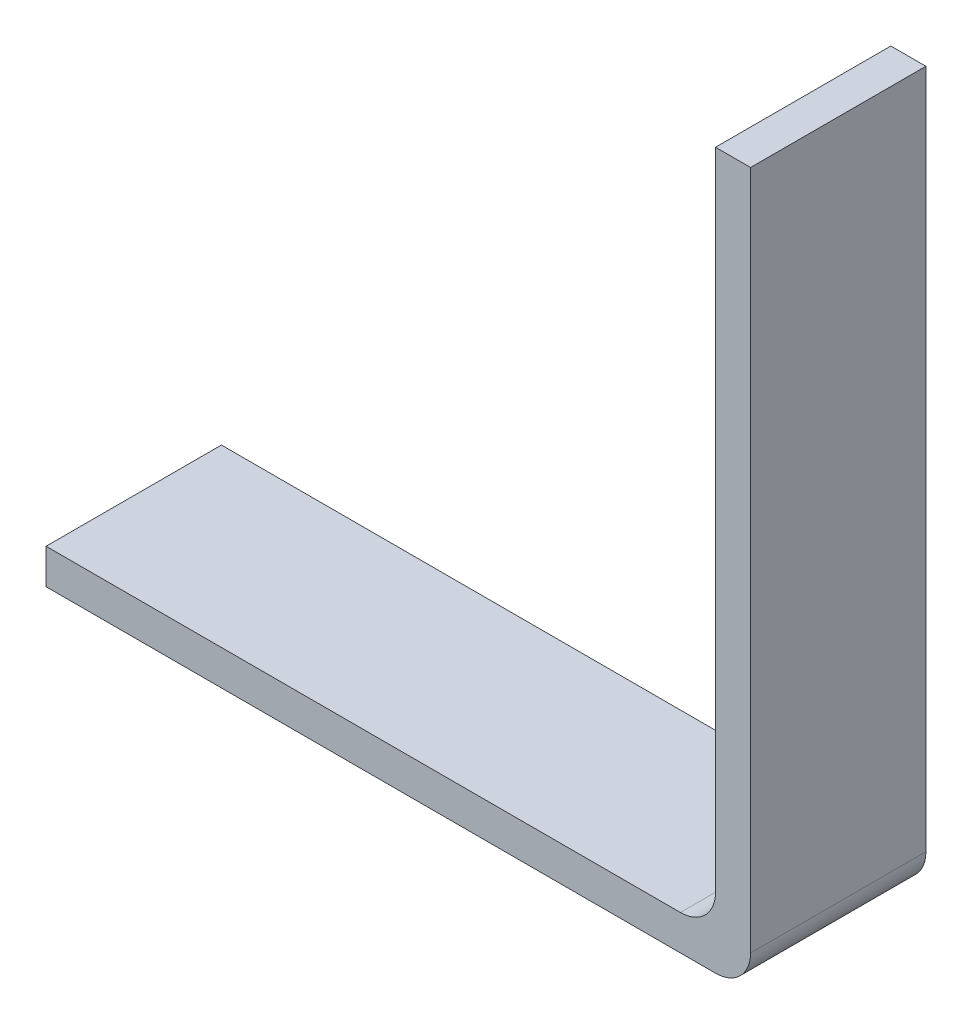
ISO-10303-21;
HEADER;
FILE_DESCRIPTION(('STEP AP214'),'2;1');
FILE_NAME('part.step','',(''),(''),'','','');
FILE_SCHEMA(('AUTOMOTIVE_DESIGN { 1 0 10303 214 1 1 1 1 }'));
ENDSEC;
DATA;
#1=APPLICATION_CONTEXT('core data for automotive mechanical design processes');
#2=APPLICATION_PROTOCOL_DEFINITION('international standard','automotive_design',2000,#1);
#3=PRODUCT_CONTEXT('',#1,'mechanical');
#4=PRODUCT('Part','Part','',(#3));
#5=PRODUCT_RELATED_PRODUCT_CATEGORY('part','',(#4));
#6=PRODUCT_DEFINITION_FORMATION('','',#4);
#7=PRODUCT_DEFINITION_CONTEXT('part definition',#1,'design');
#8=PRODUCT_DEFINITION('design','',#6,#7);
#9=PRODUCT_DEFINITION_SHAPE('','',#8);
#10=(LENGTH_UNIT() NAMED_UNIT(*) SI_UNIT(.MILLI.,.METRE.));
#11=(NAMED_UNIT(*) PLANE_ANGLE_UNIT() SI_UNIT($,.RADIAN.));
#12=(NAMED_UNIT(*) SI_UNIT($,.STERADIAN.) SOLID_ANGLE_UNIT());
#13=UNCERTAINTY_MEASURE_WITH_UNIT(LENGTH_MEASURE(1.E-05),#10,'distance_accuracy_value','');
#14=(GEOMETRIC_REPRESENTATION_CONTEXT(3) GLOBAL_UNCERTAINTY_ASSIGNED_CONTEXT((#13)) GLOBAL_UNIT_ASSIGNED_CONTEXT((#10,
#11,#12)) REPRESENTATION_CONTEXT('',''));
#15=CARTESIAN_POINT('',(0.,0.,0.));
#16=DIRECTION('',(0.,0.,1.));
#17=DIRECTION('',(1.,0.,0.));
#18=AXIS2_PLACEMENT_3D('',#15,#16,#17);
#19=CARTESIAN_POINT('',(148.868356189478,-59.4175756714224,5.));
#20=DIRECTION('',(0.,-1.,0.));
#21=DIRECTION('',(0.,0.,-1.));
#22=AXIS2_PLACEMENT_3D('',#19,#20,#21);
#23=PLANE('',#22);
#24=DIRECTION('',(1.,0.,0.));
#25=VECTOR('',#24,1.);
#26=CARTESIAN_POINT('',(148.868356189478,-59.4175756714224,5.));
#27=LINE('',#26,#25);
#28=CARTESIAN_POINT('',(146.868356189478,-59.4175756714224,5.));
#29=VERTEX_POINT('',#28);
#30=CARTESIAN_POINT('',(128.777806904857,-59.4175756714224,5.));
#31=VERTEX_POINT('',#30);
#32=EDGE_CURVE('E96',#29,#31,#27,.F.);
#33=ORIENTED_EDGE('',*,*,#32,.F.);
#34=DIRECTION('',(0.,0.,-1.));
#35=VECTOR('',#34,1.);
#36=CARTESIAN_POINT('',(146.868356189478,-59.4175756714224,0.));
#37=LINE('',#36,#35);
#38=CARTESIAN_POINT('',(146.868356189478,-59.4175756714224,0.));
#39=VERTEX_POINT('',#38);
#40=EDGE_CURVE('E115',#29,#39,#37,.T.);
#41=ORIENTED_EDGE('',*,*,#40,.T.);
#42=DIRECTION('',(1.,0.,0.));
#43=VECTOR('',#42,1.);
#44=CARTESIAN_POINT('',(148.868356189478,-59.4175756714224,0.));
#45=LINE('',#44,#43);
#46=CARTESIAN_POINT('',(128.777806904857,-59.4175756714224,0.));
#47=VERTEX_POINT('',#46);
#48=EDGE_CURVE('E111',#39,#47,#45,.F.);
#49=ORIENTED_EDGE('',*,*,#48,.T.);
#50=DIRECTION('',(0.,0.,-1.));
#51=VECTOR('',#50,1.);
#52=CARTESIAN_POINT('',(128.777806904857,-59.4175756714224,5.));
#53=LINE('',#52,#51);
#54=EDGE_CURVE('E109',#31,#47,#53,.T.);
#55=ORIENTED_EDGE('',*,*,#54,.F.);
#56=EDGE_LOOP('',(#33,#41,#49,#55));
#57=FACE_BOUND('',#56,.T.);
#58=ADVANCED_FACE('F32',(#57),#23,.F.);
#59=CARTESIAN_POINT('',(128.777806904857,-60.4175756714224,5.));
#60=DIRECTION('',(-1.,0.,0.));
#61=DIRECTION('',(0.,0.,1.));
#62=AXIS2_PLACEMENT_3D('',#59,#60,#61);
#63=PLANE('',#62);
#64=DIRECTION('',(0.,1.,0.));
#65=VECTOR('',#64,1.);
#66=CARTESIAN_POINT('',(128.777806904857,-60.4175756714224,0.));
#67=LINE('',#66,#65);
#68=CARTESIAN_POINT('',(128.777806904857,-60.4175756714224,0.));
#69=VERTEX_POINT('',#68);
#70=EDGE_CURVE('E135',#69,#47,#67,.T.);
#71=ORIENTED_EDGE('',*,*,#70,.F.);
#72=DIRECTION('',(0.,0.,-1.));
#73=VECTOR('',#72,1.);
#74=CARTESIAN_POINT('',(128.777806904857,-60.4175756714224,5.));
#75=LINE('',#74,#73);
#76=CARTESIAN_POINT('',(128.777806904857,-60.4175756714224,5.));
#77=VERTEX_POINT('',#76);
#78=EDGE_CURVE('E116',#77,#69,#75,.T.);
#79=ORIENTED_EDGE('',*,*,#78,.F.);
#80=DIRECTION('',(0.,1.,0.));
#81=VECTOR('',#80,1.);
#82=CARTESIAN_POINT('',(128.777806904857,-60.4175756714224,5.));
#83=LINE('',#82,#81);
#84=EDGE_CURVE('E100',#77,#31,#83,.T.);
#85=ORIENTED_EDGE('',*,*,#84,.T.);
#86=ORIENTED_EDGE('',*,*,#54,.T.);
#87=EDGE_LOOP('',(#71,#79,#85,#86));
#88=FACE_BOUND('',#87,.T.);
#89=ADVANCED_FACE('F119',(#88),#63,.T.);
#90=CARTESIAN_POINT('',(148.868356189478,-60.4175756714224,5.));
#91=DIRECTION('',(0.,-1.,0.));
#92=DIRECTION('',(0.,0.,-1.));
#93=AXIS2_PLACEMENT_3D('',#90,#91,#92);
#94=PLANE('',#93);
#95=DIRECTION('',(-1.,0.,0.));
#96=VECTOR('',#95,1.);
#97=CARTESIAN_POINT('',(148.868356189478,-60.4175756714224,0.));
#98=LINE('',#97,#96);
#99=CARTESIAN_POINT('',(147.868356189478,-60.4175756714224,0.));
#100=VERTEX_POINT('',#99);
#101=EDGE_CURVE('E137',#100,#69,#98,.T.);
#102=ORIENTED_EDGE('',*,*,#101,.F.);
#103=DIRECTION('',(0.,0.,-1.));
#104=VECTOR('',#103,1.);
#105=CARTESIAN_POINT('',(147.868356189478,-60.4175756714224,5.));
#106=LINE('',#105,#104);
#107=CARTESIAN_POINT('',(147.868356189478,-60.4175756714224,5.));
#108=VERTEX_POINT('',#107);
#109=EDGE_CURVE('E47',#100,#108,#106,.F.);
#110=ORIENTED_EDGE('',*,*,#109,.T.);
#111=DIRECTION('',(-1.,0.,0.));
#112=VECTOR('',#111,1.);
#113=CARTESIAN_POINT('',(148.868356189478,-60.4175756714224,5.));
#114=LINE('',#113,#112);
#115=EDGE_CURVE('E121',#108,#77,#114,.T.);
#116=ORIENTED_EDGE('',*,*,#115,.T.);
#117=ORIENTED_EDGE('',*,*,#78,.T.);
#118=EDGE_LOOP('',(#102,#110,#116,#117));
#119=FACE_BOUND('',#118,.T.);
#120=ADVANCED_FACE('F180',(#119),#94,.T.);
#121=CARTESIAN_POINT('',(148.868356189478,-40.0175756714224,5.));
#122=DIRECTION('',(1.,0.,0.));
#123=DIRECTION('',(0.,0.,-1.));
#124=AXIS2_PLACEMENT_3D('',#121,#122,#123);
#125=PLANE('',#124);
#126=DIRECTION('',(0.,-1.,0.));
#127=VECTOR('',#126,1.);
#128=CARTESIAN_POINT('',(148.868356189478,-40.0175756714224,5.));
#129=LINE('',#128,#127);
#130=CARTESIAN_POINT('',(148.868356189478,-40.0175756714224,5.));
#131=VERTEX_POINT('',#130);
#132=CARTESIAN_POINT('',(148.868356189478,-59.4175756714224,5.));
#133=VERTEX_POINT('',#132);
#134=EDGE_CURVE('E123',#131,#133,#129,.T.);
#135=ORIENTED_EDGE('',*,*,#134,.T.);
#136=DIRECTION('',(0.,0.,-1.));
#137=VECTOR('',#136,1.);
#138=CARTESIAN_POINT('',(148.868356189478,-59.4175756714224,5.));
#139=LINE('',#138,#137);
#140=CARTESIAN_POINT('',(148.868356189478,-59.4175756714224,0.));
#141=VERTEX_POINT('',#140);
#142=EDGE_CURVE('E153',#133,#141,#139,.T.);
#143=ORIENTED_EDGE('',*,*,#142,.T.);
#144=DIRECTION('',(0.,-1.,0.));
#145=VECTOR('',#144,1.);
#146=CARTESIAN_POINT('',(148.868356189478,-40.0175756714224,0.));
#147=LINE('',#146,#145);
#148=CARTESIAN_POINT('',(148.868356189478,-40.0175756714224,0.));
#149=VERTEX_POINT('',#148);
#150=EDGE_CURVE('E139',#149,#141,#147,.T.);
#151=ORIENTED_EDGE('',*,*,#150,.F.);
#152=DIRECTION('',(0.,0.,-1.));
#153=VECTOR('',#152,1.);
#154=CARTESIAN_POINT('',(148.868356189478,-40.0175756714224,5.));
#155=LINE('',#154,#153);
#156=EDGE_CURVE('E147',#131,#149,#155,.T.);
#157=ORIENTED_EDGE('',*,*,#156,.F.);
#158=EDGE_LOOP('',(#135,#143,#151,#157));
#159=FACE_BOUND('',#158,.T.);
#160=ADVANCED_FACE('F185',(#159),#125,.T.);
#161=CARTESIAN_POINT('',(147.868356189478,-40.0175756714224,5.));
#162=DIRECTION('',(0.,1.,0.));
#163=DIRECTION('',(0.,0.,1.));
#164=AXIS2_PLACEMENT_3D('',#161,#162,#163);
#165=PLANE('',#164);
#166=DIRECTION('',(1.,0.,0.));
#167=VECTOR('',#166,1.);
#168=CARTESIAN_POINT('',(147.868356189478,-40.0175756714224,0.));
#169=LINE('',#168,#167);
#170=CARTESIAN_POINT('',(147.868356189478,-40.0175756714224,0.));
#171=VERTEX_POINT('',#170);
#172=EDGE_CURVE('E141',#171,#149,#169,.T.);
#173=ORIENTED_EDGE('',*,*,#172,.F.);
#174=DIRECTION('',(0.,0.,-1.));
#175=VECTOR('',#174,1.);
#176=CARTESIAN_POINT('',(147.868356189478,-40.0175756714224,5.));
#177=LINE('',#176,#175);
#178=CARTESIAN_POINT('',(147.868356189478,-40.0175756714224,5.));
#179=VERTEX_POINT('',#178);
#180=EDGE_CURVE('E133',#179,#171,#177,.T.);
#181=ORIENTED_EDGE('',*,*,#180,.F.);
#182=DIRECTION('',(1.,0.,0.));
#183=VECTOR('',#182,1.);
#184=CARTESIAN_POINT('',(147.868356189478,-40.0175756714224,5.));
#185=LINE('',#184,#183);
#186=EDGE_CURVE('E128',#179,#131,#185,.T.);
#187=ORIENTED_EDGE('',*,*,#186,.T.);
#188=ORIENTED_EDGE('',*,*,#156,.T.);
#189=EDGE_LOOP('',(#173,#181,#187,#188));
#190=FACE_BOUND('',#189,.T.);
#191=ADVANCED_FACE('F188',(#190),#165,.T.);
#192=CARTESIAN_POINT('',(147.868356189478,-40.0175756714224,5.));
#193=DIRECTION('',(1.,0.,0.));
#194=DIRECTION('',(0.,0.,-1.));
#195=AXIS2_PLACEMENT_3D('',#192,#193,#194);
#196=PLANE('',#195);
#197=DIRECTION('',(0.,1.,0.));
#198=VECTOR('',#197,1.);
#199=CARTESIAN_POINT('',(147.868356189478,-40.0175756714224,0.));
#200=LINE('',#199,#198);
#201=CARTESIAN_POINT('',(147.868356189478,-58.4175756714224,0.));
#202=VERTEX_POINT('',#201);
#203=EDGE_CURVE('E106',#171,#202,#200,.F.);
#204=ORIENTED_EDGE('',*,*,#203,.T.);
#205=DIRECTION('',(0.,0.,-1.));
#206=VECTOR('',#205,1.);
#207=CARTESIAN_POINT('',(147.868356189478,-58.4175756714224,5.));
#208=LINE('',#207,#206);
#209=CARTESIAN_POINT('',(147.868356189478,-58.4175756714224,5.));
#210=VERTEX_POINT('',#209);
#211=EDGE_CURVE('E151',#202,#210,#208,.F.);
#212=ORIENTED_EDGE('',*,*,#211,.T.);
#213=DIRECTION('',(0.,1.,0.));
#214=VECTOR('',#213,1.);
#215=CARTESIAN_POINT('',(147.868356189478,-40.0175756714224,5.));
#216=LINE('',#215,#214);
#217=EDGE_CURVE('E131',#179,#210,#216,.F.);
#218=ORIENTED_EDGE('',*,*,#217,.F.);
#219=ORIENTED_EDGE('',*,*,#180,.T.);
#220=EDGE_LOOP('',(#204,#212,#218,#219));
#221=FACE_BOUND('',#220,.T.);
#222=ADVANCED_FACE('F165',(#221),#196,.F.);
#223=CARTESIAN_POINT('',(0.,0.,5.));
#224=DIRECTION('',(0.,0.,1.));
#225=DIRECTION('',(1.,0.,0.));
#226=AXIS2_PLACEMENT_3D('',#223,#224,#225);
#227=PLANE('',#226);
#228=ORIENTED_EDGE('',*,*,#115,.F.);
#229=CARTESIAN_POINT('',(147.868356189478,-59.4175756714224,5.));
#230=DIRECTION('',(0.,0.,1.));
#231=DIRECTION('',(1.,0.,0.));
#232=AXIS2_PLACEMENT_3D('',#229,#230,#231);
#233=CIRCLE('',#232,1.);
#234=EDGE_CURVE('E158',#108,#133,#233,.T.);
#235=ORIENTED_EDGE('',*,*,#234,.T.);
#236=ORIENTED_EDGE('',*,*,#134,.F.);
#237=ORIENTED_EDGE('',*,*,#186,.F.);
#238=ORIENTED_EDGE('',*,*,#217,.T.);
#239=CARTESIAN_POINT('',(146.868356189478,-58.4175756714224,5.));
#240=DIRECTION('',(0.,0.,1.));
#241=DIRECTION('',(1.,0.,0.));
#242=AXIS2_PLACEMENT_3D('',#239,#240,#241);
#243=CIRCLE('',#242,1.);
#244=EDGE_CURVE('E11',#210,#29,#243,.F.);
#245=ORIENTED_EDGE('',*,*,#244,.T.);
#246=ORIENTED_EDGE('',*,*,#32,.T.);
#247=ORIENTED_EDGE('',*,*,#84,.F.);
#248=EDGE_LOOP('',(#228,#235,#236,#237,#238,#245,#246,#247));
#249=FACE_BOUND('',#248,.T.);
#250=ADVANCED_FACE('F98',(#249),#227,.T.);
#251=CARTESIAN_POINT('',(0.,0.,0.));
#252=DIRECTION('',(0.,0.,1.));
#253=DIRECTION('',(1.,0.,0.));
#254=AXIS2_PLACEMENT_3D('',#251,#252,#253);
#255=PLANE('',#254);
#256=ORIENTED_EDGE('',*,*,#150,.T.);
#257=CARTESIAN_POINT('',(147.868356189478,-59.4175756714224,0.));
#258=DIRECTION('',(0.,0.,1.));
#259=DIRECTION('',(1.,0.,0.));
#260=AXIS2_PLACEMENT_3D('',#257,#258,#259);
#261=CIRCLE('',#260,1.);
#262=EDGE_CURVE('E55',#141,#100,#261,.F.);
#263=ORIENTED_EDGE('',*,*,#262,.T.);
#264=ORIENTED_EDGE('',*,*,#101,.T.);
#265=ORIENTED_EDGE('',*,*,#70,.T.);
#266=ORIENTED_EDGE('',*,*,#48,.F.);
#267=CARTESIAN_POINT('',(146.868356189478,-58.4175756714224,0.));
#268=DIRECTION('',(0.,0.,1.));
#269=DIRECTION('',(1.,0.,0.));
#270=AXIS2_PLACEMENT_3D('',#267,#268,#269);
#271=CIRCLE('',#270,1.);
#272=EDGE_CURVE('E40',#39,#202,#271,.T.);
#273=ORIENTED_EDGE('',*,*,#272,.T.);
#274=ORIENTED_EDGE('',*,*,#203,.F.);
#275=ORIENTED_EDGE('',*,*,#172,.T.);
#276=EDGE_LOOP('',(#256,#263,#264,#265,#266,#273,#274,#275));
#277=FACE_BOUND('',#276,.T.);
#278=ADVANCED_FACE('F160',(#277),#255,.F.);
#279=CARTESIAN_POINT('',(146.868356189478,-58.4175756714224,5.));
#280=DIRECTION('',(0.,0.,1.));
#281=DIRECTION('',(1.,0.,0.));
#282=AXIS2_PLACEMENT_3D('',#279,#280,#281);
#283=CYLINDRICAL_SURFACE('',#282,1.);
#284=ORIENTED_EDGE('',*,*,#244,.F.);
#285=ORIENTED_EDGE('',*,*,#211,.F.);
#286=ORIENTED_EDGE('',*,*,#272,.F.);
#287=ORIENTED_EDGE('',*,*,#40,.F.);
#288=EDGE_LOOP('',(#284,#285,#286,#287));
#289=FACE_BOUND('',#288,.T.);
#290=ADVANCED_FACE('F167',(#289),#283,.F.);
#291=CARTESIAN_POINT('',(147.868356189478,-59.4175756714224,5.));
#292=DIRECTION('',(0.,0.,-1.));
#293=DIRECTION('',(-1.,0.,0.));
#294=AXIS2_PLACEMENT_3D('',#291,#292,#293);
#295=CYLINDRICAL_SURFACE('',#294,1.);
#296=ORIENTED_EDGE('',*,*,#234,.F.);
#297=ORIENTED_EDGE('',*,*,#109,.F.);
#298=ORIENTED_EDGE('',*,*,#262,.F.);
#299=ORIENTED_EDGE('',*,*,#142,.F.);
#300=EDGE_LOOP('',(#296,#297,#298,#299));
#301=FACE_BOUND('',#300,.T.);
#302=ADVANCED_FACE('F34',(#301),#295,.T.);
#303=CLOSED_SHELL('',(#58,#89,#120,#160,#191,#222,#250,#278,#290,#302));
#304=MANIFOLD_SOLID_BREP('B2',#303);
#305=ADVANCED_BREP_SHAPE_REPRESENTATION('',(#18,#304),#14);
#306=SHAPE_DEFINITION_REPRESENTATION(#9,#305);
ENDSEC;
END-ISO-10303-21;
